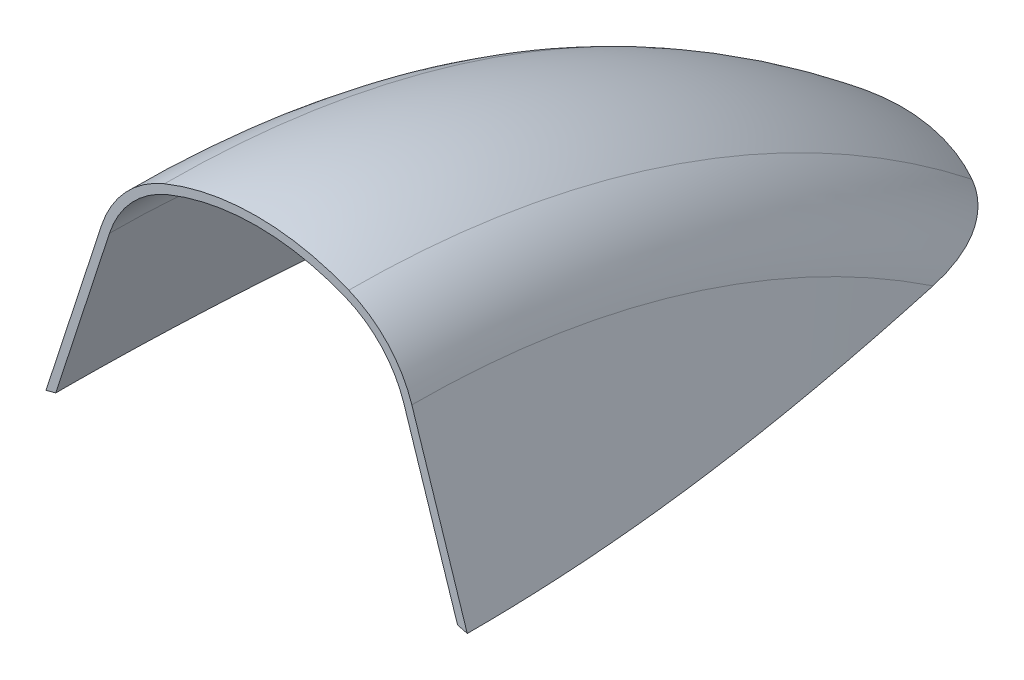
ISO-10303-21;
HEADER;
FILE_DESCRIPTION(('STEP AP214'),'2;1');
FILE_NAME('part.step','',(''),(''),'','','');
FILE_SCHEMA(('AUTOMOTIVE_DESIGN { 1 0 10303 214 1 1 1 1 }'));
ENDSEC;
DATA;
#1=APPLICATION_CONTEXT('core data for automotive mechanical design processes');
#2=APPLICATION_PROTOCOL_DEFINITION('international standard','automotive_design',2000,#1);
#3=PRODUCT_CONTEXT('',#1,'mechanical');
#4=PRODUCT('Part','Part','',(#3));
#5=PRODUCT_RELATED_PRODUCT_CATEGORY('part','',(#4));
#6=PRODUCT_DEFINITION_FORMATION('','',#4);
#7=PRODUCT_DEFINITION_CONTEXT('part definition',#1,'design');
#8=PRODUCT_DEFINITION('design','',#6,#7);
#9=PRODUCT_DEFINITION_SHAPE('','',#8);
#10=(LENGTH_UNIT() NAMED_UNIT(*) SI_UNIT(.MILLI.,.METRE.));
#11=(NAMED_UNIT(*) PLANE_ANGLE_UNIT() SI_UNIT($,.RADIAN.));
#12=(NAMED_UNIT(*) SI_UNIT($,.STERADIAN.) SOLID_ANGLE_UNIT());
#13=UNCERTAINTY_MEASURE_WITH_UNIT(LENGTH_MEASURE(1.E-05),#10,'distance_accuracy_value','');
#14=(GEOMETRIC_REPRESENTATION_CONTEXT(3) GLOBAL_UNCERTAINTY_ASSIGNED_CONTEXT((#13)) GLOBAL_UNIT_ASSIGNED_CONTEXT((#10,
#11,#12)) REPRESENTATION_CONTEXT('',''));
#15=CARTESIAN_POINT('',(0.,0.,0.));
#16=DIRECTION('',(0.,0.,1.));
#17=DIRECTION('',(1.,0.,0.));
#18=AXIS2_PLACEMENT_3D('',#15,#16,#17);
#19=CARTESIAN_POINT('',(-37.7172395441766,2.54,0.));
#20=DIRECTION('',(1.,0.,0.));
#21=DIRECTION('',(0.,1.,0.));
#22=AXIS2_PLACEMENT_3D('',#19,#20,#21);
#23=CONICAL_SURFACE('',#22,145.118964648839,1.25623994852711);
#24=CARTESIAN_POINT('',(-26.6184222879669,150.057387671849,-101.796637281608));
#25=CARTESIAN_POINT('',(-27.0836167738697,149.974875903956,-99.3986956048679));
#26=CARTESIAN_POINT('',(-27.5392318876513,149.891815533203,-96.9988982073658));
#27=CARTESIAN_POINT('',(-28.4294232160895,149.725523160584,-92.1953585088226));
#28=CARTESIAN_POINT('',(-28.8639989676616,149.642291154982,-89.7916161221535));
#29=CARTESIAN_POINT('',(-29.7103112150214,149.476565132451,-84.9794874142607));
#30=CARTESIAN_POINT('',(-30.1220422649241,149.394071295389,-82.5711001261372));
#31=CARTESIAN_POINT('',(-30.9204886709057,149.230859708308,-77.7501441464287));
#32=CARTESIAN_POINT('',(-31.3072041699647,149.150141948139,-75.3375754788241));
#33=CARTESIAN_POINT('',(-32.4239476713185,148.912809496394,-68.1107056741854));
#34=CARTESIAN_POINT('',(-33.1136455410165,148.760404723712,-63.2899394703332));
#35=CARTESIAN_POINT('',(-34.3671496983265,148.475835115361,-53.6315514986647));
#36=CARTESIAN_POINT('',(-34.9309639346418,148.343669001922,-48.7939308146964));
#37=CARTESIAN_POINT('',(-35.6691614730757,148.167252629516,-41.522994990184));
#38=CARTESIAN_POINT('',(-35.8974198674417,148.11205724624,-39.0953516135913));
#39=CARTESIAN_POINT('',(-36.3158524079679,148.01001776217,-34.2365838668223));
#40=CARTESIAN_POINT('',(-36.5060265513145,147.963173661992,-31.8054594963888));
#41=CARTESIAN_POINT('',(-36.8464235731423,147.878774108669,-26.9402929586105));
#42=CARTESIAN_POINT('',(-36.9966471890939,147.841218484061,-24.5062508459594));
#43=CARTESIAN_POINT('',(-37.2555939516596,147.776177292315,-19.6358280016336));
#44=CARTESIAN_POINT('',(-37.3643172941277,147.748691677652,-17.1994472810499));
#45=CARTESIAN_POINT('',(-37.5393879518007,147.704307868361,-12.3165993139214));
#46=CARTESIAN_POINT('',(-37.6055870036383,147.687446720398,-9.87012638903261));
#47=CARTESIAN_POINT('',(-37.694264659471,147.664838423651,-4.97633533797071));
#48=CARTESIAN_POINT('',(-37.7167432214375,147.659091285551,-2.52901721098736));
#49=CARTESIAN_POINT('',(-37.7177196503356,147.658842154436,2.36614395587297));
#50=CARTESIAN_POINT('',(-37.696208521848,147.664342461402,4.81398700074256));
#51=CARTESIAN_POINT('',(-37.631135381855,147.680933323797,8.48510559976662));
#52=CARTESIAN_POINT('',(-37.6039762773748,147.687853758858,9.70871302864501));
#53=CARTESIAN_POINT('',(-37.5388099272547,147.704430638369,12.1556202792752));
#54=CARTESIAN_POINT('',(-37.5008026843158,147.714087082138,13.3789201011034));
#55=CARTESIAN_POINT('',(-37.4574151423908,147.725089442689,14.6020232497091));
#56=B_SPLINE_CURVE_WITH_KNOTS('',3,(#24,#25,#26,#27,#28,#29,#30,#31,#32,#33,#34,#35,#36,#37,#38,
#39,#40,#41,#42,#43,#44,#45,#46,#47,#48,#49,#50,#51,#52,#53,#54,#55),.UNSPECIFIED.,.F.,.F.,(4,2,
2,2,2,2,2,2,2,2,2,2,2,2,2,4),(0.,7.3321274190093,14.6644161476476,21.9984453558849,
29.3324326416465,43.9476706116177,58.561985466632,65.8786483671059,73.1953118081105,
80.5118401771022,87.8283340164562,95.1702007247017,102.512074490705,109.855449741163,
113.527190737722,117.198930820139),.UNSPECIFIED.);
#57=CARTESIAN_POINT('',(-27.6275874930769,149.874869171961,-96.5098300668479));
#58=VERTEX_POINT('',#57);
#59=CARTESIAN_POINT('',(-37.7172395441766,147.658964648839,0.));
#60=VERTEX_POINT('',#59);
#61=EDGE_CURVE('E213',#58,#60,#56,.T.);
#62=ORIENTED_EDGE('',*,*,#61,.F.);
#63=CARTESIAN_POINT('',(-27.6275874930769,2.54,0.));
#64=DIRECTION('',(1.,0.,0.));
#65=DIRECTION('',(0.,1.,0.));
#66=AXIS2_PLACEMENT_3D('',#63,#64,#65);
#67=CIRCLE('',#66,176.129812846805);
#68=CARTESIAN_POINT('',(-27.6275874930769,178.669812846805,0.));
#69=VERTEX_POINT('',#68);
#70=EDGE_CURVE('E11',#58,#69,#67,.T.);
#71=ORIENTED_EDGE('',*,*,#70,.T.);
#72=DIRECTION('',(0.30939464681886,0.950933726670704,0.));
#73=VECTOR('',#72,1.);
#74=CARTESIAN_POINT('',(-37.7172395441766,147.658964648839,0.));
#75=LINE('',#74,#73);
#76=EDGE_CURVE('E196',#60,#69,#75,.T.);
#77=ORIENTED_EDGE('',*,*,#76,.F.);
#78=EDGE_LOOP('',(#62,#71,#77));
#79=FACE_BOUND('',#78,.T.);
#80=ADVANCED_FACE('F39',(#79),#23,.F.);
#81=CARTESIAN_POINT('',(-9.51229999999998,2.54,0.));
#82=DIRECTION('',(1.,0.,0.));
#83=DIRECTION('',(0.,1.,0.));
#84=AXIS2_PLACEMENT_3D('',#81,#82,#83);
#85=TOROIDAL_SURFACE('',#84,170.235844824906,19.05);
#86=CARTESIAN_POINT('',(-16.7035139881468,151.481855746646,-114.515774760393));
#87=CARTESIAN_POINT('',(-16.9325546605582,151.456600365142,-114.395444918006));
#88=CARTESIAN_POINT('',(-17.158253086805,151.43118701146,-114.268926084857));
#89=CARTESIAN_POINT('',(-17.6026188063665,151.380176357293,-114.004243418551));
#90=CARTESIAN_POINT('',(-17.8212878978295,151.354579105933,-113.866082596768));
#91=CARTESIAN_POINT('',(-18.4654128318662,151.27780808594,-113.43580147683));
#92=CARTESIAN_POINT('',(-18.8800466408926,151.226537261924,-113.127320251731));
#93=CARTESIAN_POINT('',(-19.6721100233312,151.125527805352,-112.478036504213));
#94=CARTESIAN_POINT('',(-20.0500225581924,151.075777758635,-112.137819303425));
#95=CARTESIAN_POINT('',(-20.7757652375651,150.977686136322,-111.426199019971));
#96=CARTESIAN_POINT('',(-21.1235766259488,150.929345451165,-111.054776773342));
#97=CARTESIAN_POINT('',(-21.880367758138,150.821726384935,-110.180440248644));
#98=CARTESIAN_POINT('',(-22.2800142671878,150.763078026673,-109.669371520665));
#99=CARTESIAN_POINT('',(-23.03248617677,150.649956368901,-108.61357098276));
#100=CARTESIAN_POINT('',(-23.3853021186774,150.595483913757,-108.068832404815));
#101=CARTESIAN_POINT('',(-24.0501296726968,150.490749284832,-106.947335396027));
#102=CARTESIAN_POINT('',(-24.3616977290594,150.440534686675,-106.370311138633));
#103=CARTESIAN_POINT('',(-24.9429803584009,150.345250746584,-105.195356781448));
#104=CARTESIAN_POINT('',(-25.2126988977805,150.300180917149,-104.597428669467));
#105=CARTESIAN_POINT('',(-25.7135465767895,150.215305409066,-103.385480355842));
#106=CARTESIAN_POINT('',(-25.9446822742957,150.175498836069,-102.771462909451));
#107=CARTESIAN_POINT('',(-26.371621970841,150.101114156458,-101.530907830739));
#108=CARTESIAN_POINT('',(-26.5674191445345,150.066537060082,-100.904367805684));
#109=CARTESIAN_POINT('',(-26.9234097492064,150.003073590079,-99.653091215329));
#110=CARTESIAN_POINT('',(-27.0841751073808,149.974096843203,-99.028521216767));
#111=CARTESIAN_POINT('',(-27.3037562788697,149.934220119302,-98.0868116511528));
#112=CARTESIAN_POINT('',(-27.3733353928906,149.92152967495,-97.7722078939753));
#113=CARTESIAN_POINT('',(-27.5056307168251,149.897314093641,-97.1415377825142));
#114=CARTESIAN_POINT('',(-27.5683474062624,149.885788875267,-96.8254715320354));
#115=CARTESIAN_POINT('',(-27.6277874930767,149.874832304284,-96.5087644470894));
#116=B_SPLINE_CURVE_WITH_KNOTS('',3,(#86,#87,#88,#89,#90,#91,#92,#93,#94,#95,#96,#97,#98,#99,
#100,#101,#102,#103,#104,#105,#106,#107,#108,#109,#110,#111,#112,#113,#114,#115),.UNSPECIFIED.,
.F.,.F.,(4,2,2,2,2,2,2,2,2,2,2,2,2,2,4),(0.,0.779655771849235,1.5591104895543,3.11441943575553,
4.64524193849431,6.17701153566008,8.1282619619542,10.0799058951881,12.0510756812357,
14.0220585300948,15.9927060316382,17.963733741203,19.899662222484,20.8669644291993,
21.8341990008006),.UNSPECIFIED.);
#117=CARTESIAN_POINT('',(-16.7037139881468,151.481833693028,-114.51566968141));
#118=VERTEX_POINT('',#117);
#119=EDGE_CURVE('E187',#118,#58,#116,.T.);
#120=ORIENTED_EDGE('',*,*,#119,.F.);
#121=CARTESIAN_POINT('',(-16.7037139881467,2.54,0.));
#122=DIRECTION('',(1.,0.,0.));
#123=DIRECTION('',(0.,1.,0.));
#124=AXIS2_PLACEMENT_3D('',#121,#122,#123);
#125=CIRCLE('',#124,187.876311509523);
#126=CARTESIAN_POINT('',(-16.7037139881468,190.416311509523,0.));
#127=VERTEX_POINT('',#126);
#128=EDGE_CURVE('E48',#118,#127,#125,.T.);
#129=ORIENTED_EDGE('',*,*,#128,.T.);
#130=CARTESIAN_POINT('',(-9.5123,172.775844824906,0.));
#131=DIRECTION('',(0.,0.,-1.));
#132=DIRECTION('',(1.,0.,0.));
#133=AXIS2_PLACEMENT_3D('',#130,#131,#132);
#134=CIRCLE('',#133,19.05);
#135=EDGE_CURVE('E186',#69,#127,#134,.T.);
#136=ORIENTED_EDGE('',*,*,#135,.F.);
#137=ORIENTED_EDGE('',*,*,#70,.F.);
#138=EDGE_LOOP('',(#120,#129,#136,#137));
#139=FACE_BOUND('',#138,.T.);
#140=ADVANCED_FACE('F184',(#139),#85,.F.);
#141=CARTESIAN_POINT('',(0.,2.54,0.));
#142=DIRECTION('',(1.,0.,0.));
#143=DIRECTION('',(0.,1.,0.));
#144=AXIS2_PLACEMENT_3D('',#141,#142,#143);
#145=TOROIDAL_SURFACE('',#144,146.902267934372,44.2480090839824);
#146=CARTESIAN_POINT('',(16.7039139881468,151.481811639142,-114.515564599629));
#147=CARTESIAN_POINT('',(16.2680149533227,151.529881421793,-114.744602114893));
#148=CARTESIAN_POINT('',(15.8273978019059,151.576560841046,-114.964961665994));
#149=CARTESIAN_POINT('',(14.9373577413709,151.666855932257,-115.387843002681));
#150=CARTESIAN_POINT('',(14.487934493252,151.71047148597,-115.5903640999));
#151=CARTESIAN_POINT('',(13.5808588437771,151.794360174644,-115.977106295521));
#152=CARTESIAN_POINT('',(13.1232048696268,151.834632662348,-116.161323851495));
#153=CARTESIAN_POINT('',(12.2005140642613,151.911559510252,-116.510963100839));
#154=CARTESIAN_POINT('',(11.7354773282205,151.948213917051,-116.676385036286));
#155=CARTESIAN_POINT('',(10.3317563560836,152.052271841464,-117.14338406277));
#156=CARTESIAN_POINT('',(9.38292162152404,152.113913713389,-117.41635152587));
#157=CARTESIAN_POINT('',(7.46522319548834,152.220080470973,-117.883021037745));
#158=CARTESIAN_POINT('',(6.49636143621871,152.264606999871,-118.076730696158));
#159=CARTESIAN_POINT('',(4.5431243734087,152.335409015095,-118.383436837516));
#160=CARTESIAN_POINT('',(3.55872048687722,152.361645530277,-118.496260989438));
#161=CARTESIAN_POINT('',(1.58355577116102,152.394973749587,-118.639417751126));
#162=CARTESIAN_POINT('',(0.592794583818713,152.40206436541,-118.669745671584));
#163=CARTESIAN_POINT('',(-1.38762705723741,152.396899283336,-118.647609830414));
#164=CARTESIAN_POINT('',(-2.37728763137691,152.384645965485,-118.595156254086));
#165=CARTESIAN_POINT('',(-4.34829890422705,152.341143041233,-118.407986426089));
#166=CARTESIAN_POINT('',(-5.32965030979635,152.309895067504,-118.273277244634));
#167=CARTESIAN_POINT('',(-7.21033763744572,152.232044744727,-117.934916855019));
#168=CARTESIAN_POINT('',(-8.11069066209438,152.186639373265,-117.736613942474));
#169=CARTESIAN_POINT('',(-9.89262342225614,152.081204280981,-117.271450654273));
#170=CARTESIAN_POINT('',(-10.7742028051884,152.021174285762,-117.004588992269));
#171=CARTESIAN_POINT('',(-12.5143336152037,151.887831951004,-116.404219699677));
#172=CARTESIAN_POINT('',(-13.3728628237726,151.814507289428,-116.07065021179));
#173=CARTESIAN_POINT('',(-14.6389462912494,151.695884000774,-115.52266314406));
#174=CARTESIAN_POINT('',(-15.0573716375385,151.654901752929,-115.332053609139));
#175=CARTESIAN_POINT('',(-15.886523071336,151.570287471594,-114.935338582808));
#176=CARTESIAN_POINT('',(-16.2972493964671,151.526655520062,-114.729233570639));
#177=CARTESIAN_POINT('',(-16.7039139881468,151.481811639142,-114.515564599629));
#178=B_SPLINE_CURVE_WITH_KNOTS('',3,(#146,#147,#148,#149,#150,#151,#152,#153,#154,#155,#156,
#157,#158,#159,#160,#161,#162,#163,#164,#165,#166,#167,#168,#169,#170,#171,#172,#173,#174,#175,
#176,#177),.UNSPECIFIED.,.F.,.F.,(4,2,2,2,2,2,2,2,2,2,2,2,2,2,2,4),(0.,1.48415203598127,
2.96836131879797,4.45285729506172,5.93733414957183,8.90126270456927,11.8649066223785,
14.8348461318607,17.8049544571499,20.7746973736065,23.7441850640536,26.5104776863591,
29.2768222156429,32.0457439350245,33.4303129279601,34.8148391169264),.UNSPECIFIED.);
#179=CARTESIAN_POINT('',(16.7037139881467,151.481833693028,-114.51566968141));
#180=VERTEX_POINT('',#179);
#181=EDGE_CURVE('E283',#180,#118,#178,.T.);
#182=ORIENTED_EDGE('',*,*,#181,.F.);
#183=CARTESIAN_POINT('',(16.7037139881468,2.54,0.));
#184=DIRECTION('',(1.,0.,0.));
#185=DIRECTION('',(0.,1.,0.));
#186=AXIS2_PLACEMENT_3D('',#183,#184,#185);
#187=CIRCLE('',#186,187.876311509523);
#188=CARTESIAN_POINT('',(16.7037139881468,190.416311509523,0.));
#189=VERTEX_POINT('',#188);
#190=EDGE_CURVE('E176',#180,#189,#187,.T.);
#191=ORIENTED_EDGE('',*,*,#190,.T.);
#192=CARTESIAN_POINT('',(0.,149.442267934372,0.));
#193=DIRECTION('',(0.,0.,-1.));
#194=DIRECTION('',(1.,0.,0.));
#195=AXIS2_PLACEMENT_3D('',#192,#193,#194);
#196=CIRCLE('',#195,44.2480090839824);
#197=EDGE_CURVE('E193',#127,#189,#196,.T.);
#198=ORIENTED_EDGE('',*,*,#197,.F.);
#199=ORIENTED_EDGE('',*,*,#128,.F.);
#200=EDGE_LOOP('',(#182,#191,#198,#199));
#201=FACE_BOUND('',#200,.T.);
#202=ADVANCED_FACE('F199',(#201),#145,.F.);
#203=CARTESIAN_POINT('',(9.51230000000002,2.54,0.));
#204=DIRECTION('',(1.,0.,0.));
#205=DIRECTION('',(0.,1.,0.));
#206=AXIS2_PLACEMENT_3D('',#203,#204,#205);
#207=TOROIDAL_SURFACE('',#206,170.235844824906,19.05);
#208=CARTESIAN_POINT('',(27.6277874930768,149.874832304284,-96.5087644470893));
#209=CARTESIAN_POINT('',(27.5369372764207,149.891574884828,-96.9927545101794));
#210=CARTESIAN_POINT('',(27.4384444740641,149.909649937155,-97.4753117513903));
#211=CARTESIAN_POINT('',(27.2250356889189,149.948556448417,-98.4368161653299));
#212=CARTESIAN_POINT('',(27.1101147036354,149.969388746808,-98.9157621914803));
#213=CARTESIAN_POINT('',(26.8621480704378,150.014002210997,-99.8713832821361));
#214=CARTESIAN_POINT('',(26.7290147825027,150.037797582523,-100.348035064023));
#215=CARTESIAN_POINT('',(26.4438572357727,150.088318710836,-101.295472719933));
#216=CARTESIAN_POINT('',(26.2918345404401,150.115044225075,-101.766259075889));
#217=CARTESIAN_POINT('',(25.9634565951117,150.172192544374,-102.712621481862));
#218=CARTESIAN_POINT('',(25.7865786761024,150.202692398718,-103.188012330138));
#219=CARTESIAN_POINT('',(25.4101493409447,150.266831913396,-104.129506270822));
#220=CARTESIAN_POINT('',(25.2105997304203,150.30047132365,-104.595610099397));
#221=CARTESIAN_POINT('',(24.7877373708552,150.3707881729,-105.515593754377));
#222=CARTESIAN_POINT('',(24.5644726466253,150.407459439988,-105.969496037895));
#223=CARTESIAN_POINT('',(24.0924159722358,150.48379531816,-106.863489999509));
#224=CARTESIAN_POINT('',(23.8436297861727,150.52345925281,-107.303584766879));
#225=CARTESIAN_POINT('',(23.3147879360126,150.606286300654,-108.174194546789));
#226=CARTESIAN_POINT('',(23.0342896477324,150.649495819879,-108.604437479738));
#227=CARTESIAN_POINT('',(22.4440109711344,150.73856660603,-109.444245219371));
#228=CARTESIAN_POINT('',(22.1342265747524,150.784428235588,-109.85380718388));
#229=CARTESIAN_POINT('',(21.4875132016503,150.877939037726,-110.644148207325));
#230=CARTESIAN_POINT('',(21.1508746544047,150.925566719104,-111.025166652594));
#231=CARTESIAN_POINT('',(20.4474243882859,151.022477680691,-111.757964111543));
#232=CARTESIAN_POINT('',(20.0806250906397,151.071760274451,-112.109755043297));
#233=CARTESIAN_POINT('',(19.4710043211811,151.151224837639,-112.644018719783));
#234=CARTESIAN_POINT('',(19.2378002537245,151.181099345433,-112.837586717424));
#235=CARTESIAN_POINT('',(18.7609423100888,151.241015526434,-113.211273776514));
#236=CARTESIAN_POINT('',(18.5172913560884,151.271057150875,-113.391396560684));
#237=CARTESIAN_POINT('',(18.0177807233971,151.331369329357,-113.738440479849));
#238=CARTESIAN_POINT('',(17.7618375616196,151.361639748467,-113.90524173194));
#239=CARTESIAN_POINT('',(17.239985811732,151.421966744154,-114.222850844216));
#240=CARTESIAN_POINT('',(16.9740713479844,151.452023181824,-114.37364906756));
#241=CARTESIAN_POINT('',(16.7035139881467,151.481855746646,-114.515774760393));
#242=B_SPLINE_CURVE_WITH_KNOTS('',3,(#208,#209,#210,#211,#212,#213,#214,#215,#216,#217,#218,
#219,#220,#221,#222,#223,#224,#225,#226,#227,#228,#229,#230,#231,#232,#233,#234,#235,#236,#237,
#238,#239,#240,#241),.UNSPECIFIED.,.F.,.F.,(4,2,2,2,2,2,2,2,2,2,2,2,2,2,2,2,4),(0.,
1.47818910341385,2.95682928821838,4.44285306956084,5.92875393563684,7.45263868174766,
8.97640214724432,10.4971366785829,12.0175285006441,13.562639168581,15.1079616056274,
16.6383886471813,18.1681885334229,19.0813992165635,19.9943561040583,20.9147719868297,
21.8357390252782),.UNSPECIFIED.);
#243=CARTESIAN_POINT('',(27.6275874930769,149.874869171961,-96.5098300668479));
#244=VERTEX_POINT('',#243);
#245=EDGE_CURVE('E277',#244,#180,#242,.T.);
#246=ORIENTED_EDGE('',*,*,#245,.F.);
#247=CARTESIAN_POINT('',(27.6275874930769,2.54,0.));
#248=DIRECTION('',(1.,0.,0.));
#249=DIRECTION('',(0.,1.,0.));
#250=AXIS2_PLACEMENT_3D('',#247,#248,#249);
#251=CIRCLE('',#250,176.129812846805);
#252=CARTESIAN_POINT('',(27.6275874930769,178.669812846805,0.));
#253=VERTEX_POINT('',#252);
#254=EDGE_CURVE('E173',#244,#253,#251,.T.);
#255=ORIENTED_EDGE('',*,*,#254,.T.);
#256=CARTESIAN_POINT('',(9.5123,172.775844824906,0.));
#257=DIRECTION('',(0.,0.,-1.));
#258=DIRECTION('',(-1.,0.,0.));
#259=AXIS2_PLACEMENT_3D('',#256,#257,#258);
#260=CIRCLE('',#259,19.05);
#261=EDGE_CURVE('E202',#189,#253,#260,.T.);
#262=ORIENTED_EDGE('',*,*,#261,.F.);
#263=ORIENTED_EDGE('',*,*,#190,.F.);
#264=EDGE_LOOP('',(#246,#255,#262,#263));
#265=FACE_BOUND('',#264,.T.);
#266=ADVANCED_FACE('F292',(#265),#207,.F.);
#267=CARTESIAN_POINT('',(27.6275874930769,2.54,0.));
#268=DIRECTION('',(-1.,0.,0.));
#269=DIRECTION('',(0.,-1.,0.));
#270=AXIS2_PLACEMENT_3D('',#267,#268,#269);
#271=CONICAL_SURFACE('',#270,176.129812846805,1.25623994852718);
#272=CARTESIAN_POINT('',(37.4574151423884,147.72508944269,14.6020232497091));
#273=CARTESIAN_POINT('',(37.5008026843134,147.714087082138,13.3789201011034));
#274=CARTESIAN_POINT('',(37.5388099272524,147.704430638369,12.1556202792752));
#275=CARTESIAN_POINT('',(37.6039762773724,147.687853758858,9.70871302864503));
#276=CARTESIAN_POINT('',(37.6311353818526,147.680933323797,8.48510559976664));
#277=CARTESIAN_POINT('',(37.6962085218456,147.664342461402,4.81398700074258));
#278=CARTESIAN_POINT('',(37.7177196503331,147.658842154436,2.366143955873));
#279=CARTESIAN_POINT('',(37.7167432214351,147.659091285551,-2.52901721098731));
#280=CARTESIAN_POINT('',(37.6942646594686,147.664838423651,-4.97633533797065));
#281=CARTESIAN_POINT('',(37.6055870036359,147.687446720398,-9.87012638903253));
#282=CARTESIAN_POINT('',(37.5393879517983,147.704307868361,-12.3165993139213));
#283=CARTESIAN_POINT('',(37.3643172941254,147.748691677653,-17.1994472810498));
#284=CARTESIAN_POINT('',(37.2555939516573,147.776177292315,-19.6358280016334));
#285=CARTESIAN_POINT('',(36.9966471890917,147.841218484062,-24.5062508459593));
#286=CARTESIAN_POINT('',(36.8464235731401,147.878774108669,-26.9402929586104));
#287=CARTESIAN_POINT('',(36.5060265513124,147.963173661993,-31.8054594963886));
#288=CARTESIAN_POINT('',(36.3158524079658,148.01001776217,-34.2365838668221));
#289=CARTESIAN_POINT('',(35.8974198674397,148.11205724624,-39.0953516135912));
#290=CARTESIAN_POINT('',(35.6691614730738,148.167252629516,-41.5229949901838));
#291=CARTESIAN_POINT('',(34.9309639346401,148.343669001923,-48.7939308146962));
#292=CARTESIAN_POINT('',(34.3671496983249,148.475835115362,-53.6315514986645));
#293=CARTESIAN_POINT('',(33.1136455410152,148.760404723712,-63.2899394703331));
#294=CARTESIAN_POINT('',(32.4239476713174,148.912809496394,-68.1107056741853));
#295=CARTESIAN_POINT('',(31.3072041699638,149.150141948139,-75.337575478824));
#296=CARTESIAN_POINT('',(30.9204886709049,149.230859708308,-77.7501441464287));
#297=CARTESIAN_POINT('',(30.1220422649236,149.394071295389,-82.5711001261371));
#298=CARTESIAN_POINT('',(29.7103112150209,149.476565132451,-84.9794874142606));
#299=CARTESIAN_POINT('',(28.8639989676614,149.642291154982,-89.7916161221534));
#300=CARTESIAN_POINT('',(28.4294232160893,149.725523160584,-92.1953585088225));
#301=CARTESIAN_POINT('',(27.5392318876513,149.891815533203,-96.9988982073658));
#302=CARTESIAN_POINT('',(27.0836167738699,149.974875903956,-99.3986956048679));
#303=CARTESIAN_POINT('',(26.6184222879672,150.057387671849,-101.796637281608));
#304=B_SPLINE_CURVE_WITH_KNOTS('',3,(#272,#273,#274,#275,#276,#277,#278,#279,#280,#281,#282,
#283,#284,#285,#286,#287,#288,#289,#290,#291,#292,#293,#294,#295,#296,#297,#298,#299,#300,#301,
#302,#303),.UNSPECIFIED.,.F.,.F.,(4,2,2,2,2,2,2,2,2,2,2,2,2,2,2,4),(0.,3.67174008241738,
7.34348107897596,14.6868563294348,22.0287300954376,29.3705968036831,36.687090643037,
44.0036190120287,51.3202824530333,58.6369453535072,73.2512602085215,87.8664981784926,
95.2004854642542,102.534514672491,109.86680340113,117.198930820139),.UNSPECIFIED.);
#305=CARTESIAN_POINT('',(37.7172395441742,147.65896464884,0.));
#306=VERTEX_POINT('',#305);
#307=EDGE_CURVE('E130',#306,#244,#304,.T.);
#308=ORIENTED_EDGE('',*,*,#307,.F.);
#309=DIRECTION('',(0.309394646818799,-0.950933726670724,0.));
#310=VECTOR('',#309,1.);
#311=CARTESIAN_POINT('',(37.7172395441742,147.65896464884,0.));
#312=LINE('',#311,#310);
#313=EDGE_CURVE('E142',#253,#306,#312,.T.);
#314=ORIENTED_EDGE('',*,*,#313,.F.);
#315=ORIENTED_EDGE('',*,*,#254,.F.);
#316=EDGE_LOOP('',(#308,#314,#315));
#317=FACE_BOUND('',#316,.T.);
#318=ADVANCED_FACE('F318',(#317),#271,.F.);
#319=CARTESIAN_POINT('',(39.5422452780172,2.54,0.));
#320=DIRECTION('',(-1.,0.,0.));
#321=DIRECTION('',(0.,-1.,0.));
#322=AXIS2_PLACEMENT_3D('',#319,#320,#321);
#323=CONICAL_SURFACE('',#322,144.640742077125,1.25623994787321);
#324=CARTESIAN_POINT('',(28.0964897117782,149.787673945074,-103.214419851348));
#325=CARTESIAN_POINT('',(28.5736072339335,149.698187515228,-100.787150916223));
#326=CARTESIAN_POINT('',(29.04109789132,149.608128803196,-98.3579940601165));
#327=CARTESIAN_POINT('',(29.9548820480397,149.427846208312,-93.4956489168778));
#328=CARTESIAN_POINT('',(30.4011750690777,149.33762232178,-91.0624605400609));
#329=CARTESIAN_POINT('',(31.2707063076764,149.157970690144,-86.1913041232441));
#330=CARTESIAN_POINT('',(31.6939387977819,149.068543147396,-83.7533350502391));
#331=CARTESIAN_POINT('',(32.5150834414547,148.891590869052,-78.873089917414));
#332=CARTESIAN_POINT('',(32.9129957427597,148.804066122355,-76.4308138828097));
#333=CARTESIAN_POINT('',(34.0625748160439,148.546677591663,-69.1153434434156));
#334=CARTESIAN_POINT('',(34.7733366249142,148.381317552922,-64.2354650509645));
#335=CARTESIAN_POINT('',(36.0665199872585,148.07231240454,-54.4581221448129));
#336=CARTESIAN_POINT('',(36.6489498395892,147.928665890937,-49.5606587891089));
#337=CARTESIAN_POINT('',(37.4124541739887,147.736715168416,-42.1991156542701));
#338=CARTESIAN_POINT('',(37.6487241450879,147.676618013159,-39.74100382429));
#339=CARTESIAN_POINT('',(38.0821466344169,147.565444049459,-34.821102997408));
#340=CARTESIAN_POINT('',(38.279299150093,147.514367241605,-32.3593140002662));
#341=CARTESIAN_POINT('',(38.632483659514,147.422266062987,-27.4326485560783));
#342=CARTESIAN_POINT('',(38.788516580578,147.38124146553,-24.9677721799179));
#343=CARTESIAN_POINT('',(39.0577926781663,147.310109162254,-20.0355284531862));
#344=CARTESIAN_POINT('',(39.1710360747202,147.280001400298,-17.5681611154891));
#345=CARTESIAN_POINT('',(39.3537818457788,147.231276772392,-12.6228702606946));
#346=CARTESIAN_POINT('',(39.4231267327718,147.212701283438,-10.1449404867755));
#347=CARTESIAN_POINT('',(39.5166220613132,147.18763169986,-5.18816550685623));
#348=CARTESIAN_POINT('',(39.5407724588657,147.181137616997,-2.70932029996733));
#349=CARTESIAN_POINT('',(39.5435875086396,147.180381621762,2.24897461416227));
#350=CARTESIAN_POINT('',(39.5222418705519,147.186122476693,4.72842433130503));
#351=CARTESIAN_POINT('',(39.4562932190765,147.203808895426,8.44692606765031));
#352=CARTESIAN_POINT('',(39.4286549524693,147.211216984901,9.6863242401397));
#353=CARTESIAN_POINT('',(39.3621612510004,147.229010025606,12.1647980603528));
#354=CARTESIAN_POINT('',(39.3233058194852,147.239394975947,13.4038737081727));
#355=CARTESIAN_POINT('',(39.2788883656272,147.251244235017,14.6427425903249));
#356=B_SPLINE_CURVE_WITH_KNOTS('',3,(#324,#325,#326,#327,#328,#329,#330,#331,#332,#333,#334,
#335,#336,#337,#338,#339,#340,#341,#342,#343,#344,#345,#346,#347,#348,#349,#350,#351,#352,#353,
#354,#355),.UNSPECIFIED.,.F.,.F.,(4,2,2,2,2,2,2,2,2,2,2,2,2,2,2,4),(0.,7.42600896063909,
14.8521853993234,22.2801979193328,29.7081670945582,44.5090816242506,59.3090387404898,
66.7192787654597,74.1295192741655,81.5395926546188,88.94962793093,96.3860985347764,
103.822576377882,111.26073638463,114.979874820766,118.699012147382),.UNSPECIFIED.);
#357=CARTESIAN_POINT('',(29.1371947632545,149.588715755328,-97.8347824409593));
#358=VERTEX_POINT('',#357);
#359=CARTESIAN_POINT('',(39.5422452780172,147.180742077125,0.));
#360=VERTEX_POINT('',#359);
#361=EDGE_CURVE('E119',#358,#360,#356,.T.);
#362=ORIENTED_EDGE('',*,*,#361,.F.);
#363=CARTESIAN_POINT('',(29.1371947632545,2.54,0.));
#364=DIRECTION('',(1.,0.,0.));
#365=DIRECTION('',(0.,1.,0.));
#366=AXIS2_PLACEMENT_3D('',#363,#364,#365);
#367=CIRCLE('',#366,176.620976841826);
#368=CARTESIAN_POINT('',(29.1371947632545,179.160976841826,0.));
#369=VERTEX_POINT('',#368);
#370=EDGE_CURVE('E146',#358,#369,#367,.T.);
#371=ORIENTED_EDGE('',*,*,#370,.T.);
#372=DIRECTION('',(-0.309394646818861,0.950933726670704,0.));
#373=VECTOR('',#372,1.);
#374=CARTESIAN_POINT('',(29.1371947841666,179.16097684863,0.));
#375=LINE('',#374,#373);
#376=EDGE_CURVE('E138',#360,#369,#375,.T.);
#377=ORIENTED_EDGE('',*,*,#376,.F.);
#378=EDGE_LOOP('',(#362,#371,#377));
#379=FACE_BOUND('',#378,.T.);
#380=ADVANCED_FACE('F145',(#379),#323,.T.);
#381=CARTESIAN_POINT('',(9.51230000000002,2.54,0.));
#382=DIRECTION('',(1.,0.,0.));
#383=DIRECTION('',(0.,1.,0.));
#384=AXIS2_PLACEMENT_3D('',#381,#382,#383);
#385=TOROIDAL_SURFACE('',#384,170.235844824906,20.6374999780088);
#386=CARTESIAN_POINT('',(17.3027984705555,151.414573819984,-116.997574969764));
#387=CARTESIAN_POINT('',(17.5500790111547,151.386316468411,-116.870396535746));
#388=CARTESIAN_POINT('',(17.7938741469879,151.357842735743,-116.736634642263));
#389=CARTESIAN_POINT('',(18.2741081570655,151.300612709555,-116.456672512988));
#390=CARTESIAN_POINT('',(18.5105487324168,151.271856483432,-116.310475183167));
#391=CARTESIAN_POINT('',(19.2074213979926,151.185494455924,-115.854888842879));
#392=CARTESIAN_POINT('',(19.6564803992588,151.12767142207,-115.52794736791));
#393=CARTESIAN_POINT('',(20.5151161535923,151.013492389181,-114.838921267107));
#394=CARTESIAN_POINT('',(20.9251982050633,150.95712755864,-114.477462053628));
#395=CARTESIAN_POINT('',(21.7132247971611,150.845796356975,-113.720566230642));
#396=CARTESIAN_POINT('',(22.0911508037775,150.790830804982,-113.325110286642));
#397=CARTESIAN_POINT('',(22.9071897109594,150.669279640956,-112.400789038236));
#398=CARTESIAN_POINT('',(23.3360191372315,150.603312044889,-111.863648003361));
#399=CARTESIAN_POINT('',(24.1444020978097,150.475829709195,-110.753137347215));
#400=CARTESIAN_POINT('',(24.5239461315211,150.414315829106,-110.179760772505));
#401=CARTESIAN_POINT('',(25.2397078921407,150.295874803104,-108.998698295879));
#402=CARTESIAN_POINT('',(25.5754758406286,150.238997229865,-108.390736388725));
#403=CARTESIAN_POINT('',(26.2025755574914,150.130897056162,-107.151789539331));
#404=CARTESIAN_POINT('',(26.4938962718955,150.079675863304,-106.520798918071));
#405=CARTESIAN_POINT('',(27.0396920425333,149.982309301336,-105.230724142248));
#406=CARTESIAN_POINT('',(27.2934970653544,149.936259119908,-104.571351021894));
#407=CARTESIAN_POINT('',(27.7620431049337,149.850210716037,-103.238419248873));
#408=CARTESIAN_POINT('',(27.9767754985525,149.810213829854,-102.564857501353));
#409=CARTESIAN_POINT('',(28.366968966182,149.736814986832,-101.218905465498));
#410=CARTESIAN_POINT('',(28.543049548596,149.703310191365,-100.546699562733));
#411=CARTESIAN_POINT('',(28.783314550041,149.657232949394,-99.5329306043524));
#412=CARTESIAN_POINT('',(28.8594026899613,149.64257527041,-99.1942264265562));
#413=CARTESIAN_POINT('',(29.0039976224411,149.614616630292,-98.5151650791159));
#414=CARTESIAN_POINT('',(29.0725048130206,149.601315597935,-98.174807997234));
#415=CARTESIAN_POINT('',(29.1373947632545,149.588676798781,-97.8337312032959));
#416=B_SPLINE_CURVE_WITH_KNOTS('',3,(#386,#387,#388,#389,#390,#391,#392,#393,#394,#395,#396,
#397,#398,#399,#400,#401,#402,#403,#404,#405,#406,#407,#408,#409,#410,#411,#412,#413,#414,#415),
.UNSPECIFIED.,.F.,.F.,(4,2,2,2,2,2,2,2,2,2,2,2,2,2,4),(0.,0.838283501081054,1.67637164350959,
3.34890979737068,4.9954443722183,6.64292163247523,8.71120688005741,10.7798902346838,
12.8683866375784,14.9574016031779,17.080108677025,19.2032836553074,21.2894352572088,
22.3317248175168,23.3739596288432),.UNSPECIFIED.);
#417=CARTESIAN_POINT('',(17.3029984705556,151.414550964985,-116.997472063782));
#418=VERTEX_POINT('',#417);
#419=EDGE_CURVE('E125',#418,#358,#416,.T.);
#420=ORIENTED_EDGE('',*,*,#419,.F.);
#421=CARTESIAN_POINT('',(17.3029984705556,2.54,0.));
#422=DIRECTION('',(1.,0.,0.));
#423=DIRECTION('',(0.,1.,0.));
#424=AXIS2_PLACEMENT_3D('',#421,#422,#423);
#425=CIRCLE('',#424,189.34635035918);
#426=CARTESIAN_POINT('',(17.3029984705556,191.88635035918,0.));
#427=VERTEX_POINT('',#426);
#428=EDGE_CURVE('E168',#418,#427,#425,.T.);
#429=ORIENTED_EDGE('',*,*,#428,.T.);
#430=CARTESIAN_POINT('',(9.5123,172.775844824906,0.));
#431=DIRECTION('',(0.,0.,1.));
#432=DIRECTION('',(1.,0.,0.));
#433=AXIS2_PLACEMENT_3D('',#430,#431,#432);
#434=CIRCLE('',#433,20.6374999780088);
#435=EDGE_CURVE('E148',#369,#427,#434,.T.);
#436=ORIENTED_EDGE('',*,*,#435,.F.);
#437=ORIENTED_EDGE('',*,*,#370,.F.);
#438=EDGE_LOOP('',(#420,#429,#436,#437));
#439=FACE_BOUND('',#438,.T.);
#440=ADVANCED_FACE('F324',(#439),#385,.T.);
#441=CARTESIAN_POINT('',(0.,2.54,0.));
#442=DIRECTION('',(1.,0.,0.));
#443=DIRECTION('',(0.,1.,0.));
#444=AXIS2_PLACEMENT_3D('',#441,#442,#443);
#445=TOROIDAL_SURFACE('',#444,146.902267934372,45.83550904);
#446=CARTESIAN_POINT('',(-17.3031984788573,151.414528108769,-116.997369189401));
#447=CARTESIAN_POINT('',(-16.842838716271,151.467140339496,-117.2341681978));
#448=CARTESIAN_POINT('',(-16.3775525933957,151.518181276433,-117.461746607492));
#449=CARTESIAN_POINT('',(-15.4378187369702,151.616808698489,-117.89798657513));
#450=CARTESIAN_POINT('',(-14.9633707038838,151.664395070422,-118.106647513322));
#451=CARTESIAN_POINT('',(-14.0059599394953,151.755805118666,-118.504592252323));
#452=CARTESIAN_POINT('',(-13.5229958954568,151.79962820865,-118.693873034541));
#453=CARTESIAN_POINT('',(-12.5494462563429,151.88321253188,-119.052580105089));
#454=CARTESIAN_POINT('',(-12.0588607472988,151.922973810938,-119.222006617351));
#455=CARTESIAN_POINT('',(-10.5781753980411,152.035654054018,-119.699477923657));
#456=CARTESIAN_POINT('',(-9.57763713091751,152.102114814169,-119.977342402731));
#457=CARTESIAN_POINT('',(-7.55622140684111,152.215927522437,-120.449732056308));
#458=CARTESIAN_POINT('',(-6.53534569716452,152.263281104767,-120.644264358194));
#459=CARTESIAN_POINT('',(-4.47829387561852,152.337670545311,-120.948622456844));
#460=CARTESIAN_POINT('',(-3.44209255105521,152.364667938439,-121.058287899306));
#461=CARTESIAN_POINT('',(-1.36377133642929,152.397442029814,-121.19130433786));
#462=CARTESIAN_POINT('',(-0.321651097927099,152.403217465504,-121.214650198548));
#463=CARTESIAN_POINT('',(1.7605936618873,152.393385934747,-121.174815882927));
#464=CARTESIAN_POINT('',(2.80071857616635,152.377783732733,-121.111654986383));
#465=CARTESIAN_POINT('',(4.87153979625924,152.325640027993,-120.899407918098));
#466=CARTESIAN_POINT('',(5.90223713548182,152.28910084892,-120.750331281557));
#467=CARTESIAN_POINT('',(7.82806892648709,152.201510971635,-120.389860808269));
#468=CARTESIAN_POINT('',(8.72504777342986,152.15263790584,-120.18771280698));
#469=CARTESIAN_POINT('',(10.5009851102801,152.040392355487,-119.718815637418));
#470=CARTESIAN_POINT('',(11.3799442792591,151.977020418417,-119.452068908419));
#471=CARTESIAN_POINT('',(13.1157367764838,151.837070120023,-118.855671934806));
#472=CARTESIAN_POINT('',(13.9725588830576,151.760485206177,-118.525990471196));
#473=CARTESIAN_POINT('',(15.2374228390293,151.636937093593,-117.986231319772));
#474=CARTESIAN_POINT('',(15.6556777294507,151.594305992486,-117.798757467747));
#475=CARTESIAN_POINT('',(16.4849590112549,151.506369476743,-117.409053020287));
#476=CARTESIAN_POINT('',(16.8959855606467,151.46106412066,-117.206822747921));
#477=CARTESIAN_POINT('',(17.3031984705556,151.414528109718,-116.997369193671));
#478=B_SPLINE_CURVE_WITH_KNOTS('',3,(#446,#447,#448,#449,#450,#451,#452,#453,#454,#455,#456,
#457,#458,#459,#460,#461,#462,#463,#464,#465,#466,#467,#468,#469,#470,#471,#472,#473,#474,#475,
#476,#477),.UNSPECIFIED.,.F.,.F.,(4,2,2,2,2,2,2,2,2,2,2,2,2,2,2,4),(0.,1.56097116793374,
3.12199345640519,4.68325851613743,6.24450596502916,9.36209189151472,12.4794111182844,
15.6026061751768,18.7259870370357,21.8486719041276,24.9710102725107,27.7308009238487,
30.4904873805885,33.2515463635844,34.6322683193355,36.0129600553507),.UNSPECIFIED.);
#479=CARTESIAN_POINT('',(-17.3029984788573,151.414550964036,-116.997472097946));
#480=VERTEX_POINT('',#479);
#481=EDGE_CURVE('E249',#480,#418,#478,.T.);
#482=ORIENTED_EDGE('',*,*,#481,.F.);
#483=CARTESIAN_POINT('',(-17.3029984788573,2.54,0.));
#484=DIRECTION('',(1.,0.,0.));
#485=DIRECTION('',(0.,1.,0.));
#486=AXIS2_PLACEMENT_3D('',#483,#484,#485);
#487=CIRCLE('',#486,189.346350379544);
#488=CARTESIAN_POINT('',(-17.3029984788573,191.886350379544,0.));
#489=VERTEX_POINT('',#488);
#490=EDGE_CURVE('E63',#480,#489,#487,.T.);
#491=ORIENTED_EDGE('',*,*,#490,.T.);
#492=CARTESIAN_POINT('',(0.,149.442267934372,0.));
#493=DIRECTION('',(0.,0.,1.));
#494=DIRECTION('',(1.,0.,0.));
#495=AXIS2_PLACEMENT_3D('',#492,#493,#494);
#496=CIRCLE('',#495,45.83550904);
#497=EDGE_CURVE('E151',#427,#489,#496,.T.);
#498=ORIENTED_EDGE('',*,*,#497,.F.);
#499=ORIENTED_EDGE('',*,*,#428,.F.);
#500=EDGE_LOOP('',(#482,#491,#498,#499));
#501=FACE_BOUND('',#500,.T.);
#502=ADVANCED_FACE('F329',(#501),#445,.T.);
#503=CARTESIAN_POINT('',(-9.51229999999998,2.54,0.));
#504=DIRECTION('',(1.,0.,0.));
#505=DIRECTION('',(0.,1.,0.));
#506=AXIS2_PLACEMENT_3D('',#503,#504,#505);
#507=TOROIDAL_SURFACE('',#506,170.235844824906,20.6374999780088);
#508=CARTESIAN_POINT('',(-29.1373947841667,149.588676794708,-97.833731093371));
#509=CARTESIAN_POINT('',(-29.0570559998122,149.604323137718,-98.2559866476137));
#510=CARTESIAN_POINT('',(-28.9711736189796,149.620986653464,-98.6771699666691));
#511=CARTESIAN_POINT('',(-28.7876573719809,149.656405480706,-99.516947069983));
#512=CARTESIAN_POINT('',(-28.6900216319967,149.675161125712,-99.9355404301144));
#513=CARTESIAN_POINT('',(-28.4821283265049,149.71486086745,-100.770486291169));
#514=CARTESIAN_POINT('',(-28.3718431303711,149.73580974589,-101.186831723636));
#515=CARTESIAN_POINT('',(-28.1381421368446,149.779901970719,-102.015667946872));
#516=CARTESIAN_POINT('',(-28.0147269083822,149.803045222021,-102.428158903816));
#517=CARTESIAN_POINT('',(-27.6187059600724,149.876751748498,-103.674556111145));
#518=CARTESIAN_POINT('',(-27.3242110541884,149.930841924031,-104.501465499888));
#519=CARTESIAN_POINT('',(-26.6714156946534,150.048344508125,-106.12844492741));
#520=CARTESIAN_POINT('',(-26.3131744743333,150.111748253017,-106.928539069811));
#521=CARTESIAN_POINT('',(-25.657742979478,150.2248662417,-108.23106358311));
#522=CARTESIAN_POINT('',(-25.3801650225317,150.27207337856,-108.7436060274));
#523=CARTESIAN_POINT('',(-24.7918287304436,150.370257378221,-109.749050317543));
#524=CARTESIAN_POINT('',(-24.4810695445962,150.421234337663,-110.241951659388));
#525=CARTESIAN_POINT('',(-23.8276370990623,150.526117987816,-111.199467750636));
#526=CARTESIAN_POINT('',(-23.4852699900346,150.579994822111,-111.664293902407));
#527=CARTESIAN_POINT('',(-22.765088117321,150.690555306763,-112.565386960122));
#528=CARTESIAN_POINT('',(-22.3872761238038,150.74723873761,-113.001656093401));
#529=CARTESIAN_POINT('',(-21.6546356993523,150.854076896028,-113.777457104401));
#530=CARTESIAN_POINT('',(-21.3047747845392,150.903945478499,-114.121715638655));
#531=CARTESIAN_POINT('',(-20.5792204173122,151.004601843377,-114.781476025205));
#532=CARTESIAN_POINT('',(-20.2035375486639,151.05538924297,-115.096989537493));
#533=CARTESIAN_POINT('',(-19.4215949321364,151.15792763776,-115.699414061597));
#534=CARTESIAN_POINT('',(-19.0149900004696,151.20968236815,-115.985879865686));
#535=CARTESIAN_POINT('',(-18.3866394257601,151.286933159744,-116.387220010822));
#536=CARTESIAN_POINT('',(-18.1739378782616,151.312640277678,-116.51636553313));
#537=CARTESIAN_POINT('',(-17.7426863548446,151.363814214088,-116.764625475527));
#538=CARTESIAN_POINT('',(-17.5241354157931,151.389280992046,-116.88373823011));
#539=CARTESIAN_POINT('',(-17.3027984788573,151.414573819035,-116.997574965494));
#540=B_SPLINE_CURVE_WITH_KNOTS('',3,(#508,#509,#510,#511,#512,#513,#514,#515,#516,#517,#518,
#519,#520,#521,#522,#523,#524,#525,#526,#527,#528,#529,#530,#531,#532,#533,#534,#535,#536,#537,
#538,#539),.UNSPECIFIED.,.F.,.F.,(4,2,2,2,2,2,2,2,2,2,2,2,2,2,2,4),(0.,1.2903343866741,
2.5808747623039,3.87428981181649,5.16764883987266,7.80348488835344,10.4368843768613,
12.1901469828285,13.943454550012,15.6812747939849,17.4189593328594,18.8976462226835,
20.3757306093189,21.8738316913503,22.6240831306714,23.3744588721843),.UNSPECIFIED.);
#541=CARTESIAN_POINT('',(-29.1371947841666,149.588715751254,-97.8347824593646));
#542=VERTEX_POINT('',#541);
#543=EDGE_CURVE('E241',#542,#480,#540,.T.);
#544=ORIENTED_EDGE('',*,*,#543,.F.);
#545=CARTESIAN_POINT('',(-29.1371947841666,2.54,0.));
#546=DIRECTION('',(1.,0.,0.));
#547=DIRECTION('',(0.,1.,0.));
#548=AXIS2_PLACEMENT_3D('',#545,#546,#547);
#549=CIRCLE('',#548,176.62097684863);
#550=CARTESIAN_POINT('',(-29.1371947841667,179.16097684863,0.));
#551=VERTEX_POINT('',#550);
#552=EDGE_CURVE('E55',#542,#551,#549,.T.);
#553=ORIENTED_EDGE('',*,*,#552,.T.);
#554=CARTESIAN_POINT('',(-9.5123,172.775844824906,0.));
#555=DIRECTION('',(0.,0.,1.));
#556=DIRECTION('',(-1.,0.,0.));
#557=AXIS2_PLACEMENT_3D('',#554,#555,#556);
#558=CIRCLE('',#557,20.6374999780088);
#559=EDGE_CURVE('E157',#489,#551,#558,.T.);
#560=ORIENTED_EDGE('',*,*,#559,.F.);
#561=ORIENTED_EDGE('',*,*,#490,.F.);
#562=EDGE_LOOP('',(#544,#553,#560,#561));
#563=FACE_BOUND('',#562,.T.);
#564=ADVANCED_FACE('F333',(#563),#507,.T.);
#565=CARTESIAN_POINT('',(-29.1371947841666,2.54,0.));
#566=DIRECTION('',(1.,0.,0.));
#567=DIRECTION('',(0.,1.,0.));
#568=AXIS2_PLACEMENT_3D('',#565,#566,#567);
#569=CONICAL_SURFACE('',#568,176.62097684863,1.25623994852719);
#570=CARTESIAN_POINT('',(-39.2788883662446,147.251244234852,14.642742590889));
#571=CARTESIAN_POINT('',(-39.3233058200021,147.239394975809,13.403873708577));
#572=CARTESIAN_POINT('',(-39.3621612514289,147.229010025491,12.1647980605983));
#573=CARTESIAN_POINT('',(-39.4286549527449,147.211216984827,9.68632424006895));
#574=CARTESIAN_POINT('',(-39.4562932192879,147.203808895369,8.44692606742221));
#575=CARTESIAN_POINT('',(-39.5222418706076,147.186122476678,4.72842433060629));
#576=CARTESIAN_POINT('',(-39.5435875086408,147.180381621762,2.24897461315187));
#577=CARTESIAN_POINT('',(-39.5407724588572,147.181137616999,-2.70932030160421));
#578=CARTESIAN_POINT('',(-39.5166220613495,147.18763169985,-5.18816550880792));
#579=CARTESIAN_POINT('',(-39.4231267329962,147.212701283378,-10.1449404893608));
#580=CARTESIAN_POINT('',(-39.3537818461465,147.231276772294,-12.6228702635987));
#581=CARTESIAN_POINT('',(-39.1710360754683,147.280001400099,-17.5681611190744));
#582=CARTESIAN_POINT('',(-39.0577926791504,147.310109161993,-20.0355284571339));
#583=CARTESIAN_POINT('',(-38.7885165821243,147.381241465123,-24.9677721846012));
#584=CARTESIAN_POINT('',(-38.6324836613864,147.422266062496,-27.4326485611348));
#585=CARTESIAN_POINT('',(-38.2792991527024,147.514367240927,-32.3593140060822));
#586=CARTESIAN_POINT('',(-38.0821466374373,147.565444048679,-34.8211030036103));
#587=CARTESIAN_POINT('',(-37.6487241490093,147.676618012159,-39.7410038312805));
#588=CARTESIAN_POINT('',(-37.4124541784001,147.736715167298,-42.1991156616624));
#589=CARTESIAN_POINT('',(-36.648949845575,147.928665889451,-49.5606587977609));
#590=CARTESIAN_POINT('',(-36.0665199944365,148.072312402786,-54.4581221543475));
#591=CARTESIAN_POINT('',(-34.7733366347134,148.38131755062,-64.2354650623347));
#592=CARTESIAN_POINT('',(-34.0625748272722,148.546677589081,-69.115343455739));
#593=CARTESIAN_POINT('',(-32.9129957562826,148.804066119362,-76.4308138965774));
#594=CARTESIAN_POINT('',(-32.5150834557727,148.891590865923,-78.8730899316475));
#595=CARTESIAN_POINT('',(-31.6939388137335,149.068543144002,-83.7533350654202));
#596=CARTESIAN_POINT('',(-31.2707063244665,149.157970686621,-86.1913041389072));
#597=CARTESIAN_POINT('',(-30.4011750875826,149.337622318011,-91.0624605567062));
#598=CARTESIAN_POINT('',(-29.9548820674209,149.427846204424,-93.4956489340232));
#599=CARTESIAN_POINT('',(-29.0410979124879,149.608128799085,-98.357994078277));
#600=CARTESIAN_POINT('',(-28.5736072560117,149.698187511011,-100.787150934899));
#601=CARTESIAN_POINT('',(-28.0964897347819,149.78767394076,-103.214419870545));
#602=B_SPLINE_CURVE_WITH_KNOTS('',3,(#570,#571,#572,#573,#574,#575,#576,#577,#578,#579,#580,
#581,#582,#583,#584,#585,#586,#587,#588,#589,#590,#591,#592,#593,#594,#595,#596,#597,#598,#599,
#600,#601),.UNSPECIFIED.,.F.,.F.,(4,2,2,2,2,2,2,2,2,2,2,2,2,2,2,4),(0.,3.71913732708403,
7.43827576368682,14.876435771371,22.3129136154213,29.7493842202127,37.1594194975769,
44.5694928790831,51.9797333888406,59.3899734148622,74.1899305332929,88.990845065173,
96.418814241379,103.846826762369,111.273003202041,118.699012163669),.UNSPECIFIED.);
#603=CARTESIAN_POINT('',(-39.5422452780142,147.180742077126,0.));
#604=VERTEX_POINT('',#603);
#605=EDGE_CURVE('E233',#604,#542,#602,.T.);
#606=ORIENTED_EDGE('',*,*,#605,.F.);
#607=DIRECTION('',(-0.309394646818786,-0.950933726670728,0.));
#608=VECTOR('',#607,1.);
#609=CARTESIAN_POINT('',(-29.1371947841667,179.16097684863,0.));
#610=LINE('',#609,#608);
#611=EDGE_CURVE('E160',#551,#604,#610,.T.);
#612=ORIENTED_EDGE('',*,*,#611,.F.);
#613=ORIENTED_EDGE('',*,*,#552,.F.);
#614=EDGE_LOOP('',(#606,#612,#613));
#615=FACE_BOUND('',#614,.T.);
#616=ADVANCED_FACE('F306',(#615),#569,.T.);
#617=CARTESIAN_POINT('',(0.,0.,0.));
#618=DIRECTION('',(0.,0.,1.));
#619=DIRECTION('',(1.,0.,0.));
#620=AXIS2_PLACEMENT_3D('',#617,#618,#619);
#621=PLANE('',#620);
#622=CARTESIAN_POINT('',(0.,0.,0.));
#623=DIRECTION('',(0.,0.,-1.));
#624=DIRECTION('',(1.,0.,0.));
#625=AXIS2_PLACEMENT_3D('',#622,#623,#624);
#626=CIRCLE('',#625,152.4);
#627=EDGE_CURVE('E210',#604,#60,#626,.T.);
#628=ORIENTED_EDGE('',*,*,#627,.T.);
#629=ORIENTED_EDGE('',*,*,#76,.T.);
#630=ORIENTED_EDGE('',*,*,#135,.T.);
#631=ORIENTED_EDGE('',*,*,#197,.T.);
#632=ORIENTED_EDGE('',*,*,#261,.T.);
#633=ORIENTED_EDGE('',*,*,#313,.T.);
#634=CARTESIAN_POINT('',(0.,0.,0.));
#635=DIRECTION('',(0.,0.,-1.));
#636=DIRECTION('',(1.,0.,0.));
#637=AXIS2_PLACEMENT_3D('',#634,#635,#636);
#638=CIRCLE('',#637,152.4);
#639=EDGE_CURVE('E122',#306,#360,#638,.T.);
#640=ORIENTED_EDGE('',*,*,#639,.T.);
#641=ORIENTED_EDGE('',*,*,#376,.T.);
#642=ORIENTED_EDGE('',*,*,#435,.T.);
#643=ORIENTED_EDGE('',*,*,#497,.T.);
#644=ORIENTED_EDGE('',*,*,#559,.T.);
#645=ORIENTED_EDGE('',*,*,#611,.T.);
#646=EDGE_LOOP('',(#628,#629,#630,#631,#632,#633,#640,#641,#642,#643,#644,#645));
#647=FACE_BOUND('',#646,.T.);
#648=ADVANCED_FACE('F136',(#647),#621,.T.);
#649=CARTESIAN_POINT('',(0.,0.,-309.88));
#650=DIRECTION('',(0.,0.,1.));
#651=DIRECTION('',(1.,0.,0.));
#652=AXIS2_PLACEMENT_3D('',#649,#650,#651);
#653=CYLINDRICAL_SURFACE('',#652,152.4);
#654=ORIENTED_EDGE('',*,*,#61,.T.);
#655=ORIENTED_EDGE('',*,*,#627,.F.);
#656=ORIENTED_EDGE('',*,*,#605,.T.);
#657=ORIENTED_EDGE('',*,*,#543,.T.);
#658=ORIENTED_EDGE('',*,*,#481,.T.);
#659=ORIENTED_EDGE('',*,*,#419,.T.);
#660=ORIENTED_EDGE('',*,*,#361,.T.);
#661=ORIENTED_EDGE('',*,*,#639,.F.);
#662=ORIENTED_EDGE('',*,*,#307,.T.);
#663=ORIENTED_EDGE('',*,*,#245,.T.);
#664=ORIENTED_EDGE('',*,*,#181,.T.);
#665=ORIENTED_EDGE('',*,*,#119,.T.);
#666=EDGE_LOOP('',(#654,#655,#656,#657,#658,#659,#660,#661,#662,#663,#664,#665));
#667=FACE_BOUND('',#666,.T.);
#668=ADVANCED_FACE('F121',(#667),#653,.F.);
#669=CLOSED_SHELL('',(#80,#140,#202,#266,#318,#380,#440,#502,#564,#616,#648,#668));
#670=MANIFOLD_SOLID_BREP('B2',#669);
#671=ADVANCED_BREP_SHAPE_REPRESENTATION('',(#18,#670),#14);
#672=SHAPE_DEFINITION_REPRESENTATION(#9,#671);
ENDSEC;
END-ISO-10303-21;
